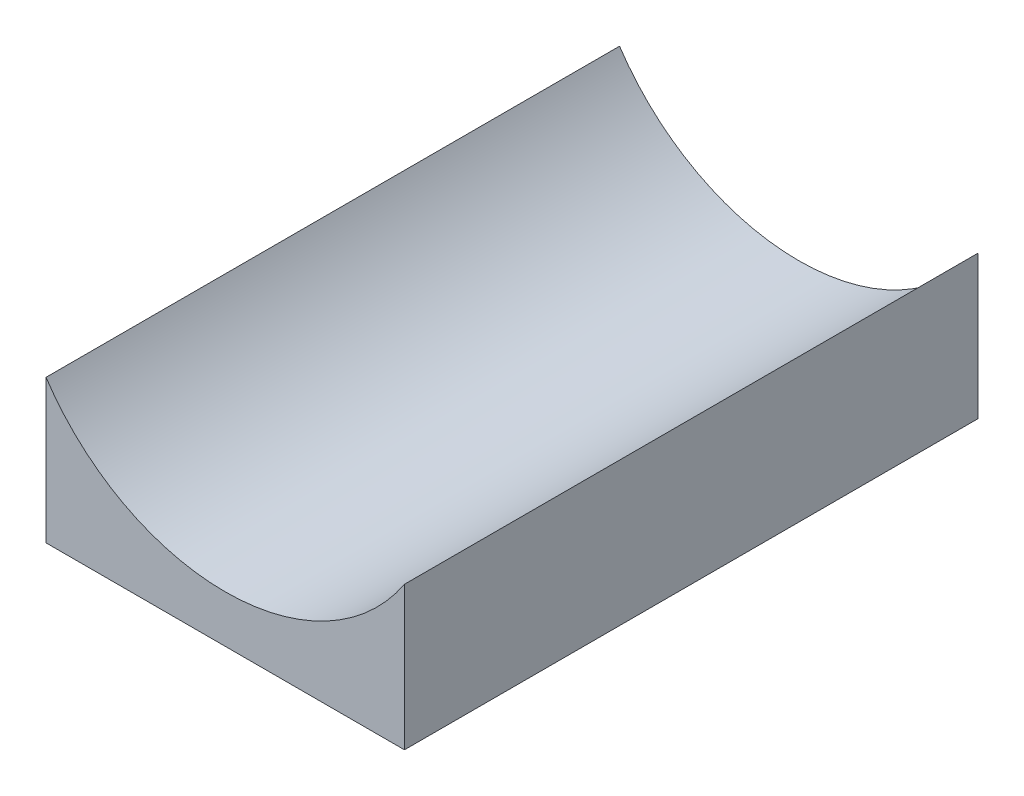
ISO-10303-21;
HEADER;
FILE_DESCRIPTION(('STEP AP214'),'2;1');
FILE_NAME('part.step','',(''),(''),'','','');
FILE_SCHEMA(('AUTOMOTIVE_DESIGN { 1 0 10303 214 1 1 1 1 }'));
ENDSEC;
DATA;
#1=APPLICATION_CONTEXT('core data for automotive mechanical design processes');
#2=APPLICATION_PROTOCOL_DEFINITION('international standard','automotive_design',2000,#1);
#3=PRODUCT_CONTEXT('',#1,'mechanical');
#4=PRODUCT('Part','Part','',(#3));
#5=PRODUCT_RELATED_PRODUCT_CATEGORY('part','',(#4));
#6=PRODUCT_DEFINITION_FORMATION('','',#4);
#7=PRODUCT_DEFINITION_CONTEXT('part definition',#1,'design');
#8=PRODUCT_DEFINITION('design','',#6,#7);
#9=PRODUCT_DEFINITION_SHAPE('','',#8);
#10=(LENGTH_UNIT() NAMED_UNIT(*) SI_UNIT(.MILLI.,.METRE.));
#11=(NAMED_UNIT(*) PLANE_ANGLE_UNIT() SI_UNIT($,.RADIAN.));
#12=(NAMED_UNIT(*) SI_UNIT($,.STERADIAN.) SOLID_ANGLE_UNIT());
#13=UNCERTAINTY_MEASURE_WITH_UNIT(LENGTH_MEASURE(1.E-05),#10,'distance_accuracy_value','');
#14=(GEOMETRIC_REPRESENTATION_CONTEXT(3) GLOBAL_UNCERTAINTY_ASSIGNED_CONTEXT((#13)) GLOBAL_UNIT_ASSIGNED_CONTEXT((#10,
#11,#12)) REPRESENTATION_CONTEXT('',''));
#15=CARTESIAN_POINT('',(0.,0.,0.));
#16=DIRECTION('',(0.,0.,1.));
#17=DIRECTION('',(1.,0.,0.));
#18=AXIS2_PLACEMENT_3D('',#15,#16,#17);
#19=CARTESIAN_POINT('',(12.5,5.,40.));
#20=DIRECTION('',(-1.,0.,0.));
#21=DIRECTION('',(0.,0.,1.));
#22=AXIS2_PLACEMENT_3D('',#19,#20,#21);
#23=PLANE('',#22);
#24=DIRECTION('',(0.,1.,0.));
#25=VECTOR('',#24,1.);
#26=CARTESIAN_POINT('',(12.5,5.,0.));
#27=LINE('',#26,#25);
#28=CARTESIAN_POINT('',(12.5,-5.,0.));
#29=VERTEX_POINT('',#28);
#30=CARTESIAN_POINT('',(12.5,5.,0.));
#31=VERTEX_POINT('',#30);
#32=EDGE_CURVE('E100',#29,#31,#27,.T.);
#33=ORIENTED_EDGE('',*,*,#32,.T.);
#34=DIRECTION('',(0.,0.,-1.));
#35=VECTOR('',#34,1.);
#36=CARTESIAN_POINT('',(12.5,5.,40.));
#37=LINE('',#36,#35);
#38=CARTESIAN_POINT('',(12.5,5.,40.));
#39=VERTEX_POINT('',#38);
#40=EDGE_CURVE('E11',#39,#31,#37,.T.);
#41=ORIENTED_EDGE('',*,*,#40,.F.);
#42=DIRECTION('',(0.,1.,0.));
#43=VECTOR('',#42,1.);
#44=CARTESIAN_POINT('',(12.5,5.,40.));
#45=LINE('',#44,#43);
#46=CARTESIAN_POINT('',(12.5,-5.,40.));
#47=VERTEX_POINT('',#46);
#48=EDGE_CURVE('E88',#47,#39,#45,.T.);
#49=ORIENTED_EDGE('',*,*,#48,.F.);
#50=DIRECTION('',(0.,0.,-1.));
#51=VECTOR('',#50,1.);
#52=CARTESIAN_POINT('',(12.5,-5.,40.));
#53=LINE('',#52,#51);
#54=EDGE_CURVE('E96',#47,#29,#53,.T.);
#55=ORIENTED_EDGE('',*,*,#54,.T.);
#56=EDGE_LOOP('',(#33,#41,#49,#55));
#57=FACE_BOUND('',#56,.T.);
#58=ADVANCED_FACE('F37',(#57),#23,.F.);
#59=CARTESIAN_POINT('',(0.,13.2915619758885,40.));
#60=DIRECTION('',(0.,0.,-1.));
#61=DIRECTION('',(-1.,0.,0.));
#62=AXIS2_PLACEMENT_3D('',#59,#60,#61);
#63=CYLINDRICAL_SURFACE('',#62,15.);
#64=CARTESIAN_POINT('',(0.,13.2915619758885,0.));
#65=DIRECTION('',(0.,0.,-1.));
#66=DIRECTION('',(1.,0.,0.));
#67=AXIS2_PLACEMENT_3D('',#64,#65,#66);
#68=CIRCLE('',#67,15.);
#69=CARTESIAN_POINT('',(-12.5,4.99999999999999,0.));
#70=VERTEX_POINT('',#69);
#71=EDGE_CURVE('E92',#31,#70,#68,.T.);
#72=ORIENTED_EDGE('',*,*,#71,.T.);
#73=DIRECTION('',(0.,0.,-1.));
#74=VECTOR('',#73,1.);
#75=CARTESIAN_POINT('',(-12.5,4.99999999999999,40.));
#76=LINE('',#75,#74);
#77=CARTESIAN_POINT('',(-12.5,4.99999999999999,40.));
#78=VERTEX_POINT('',#77);
#79=EDGE_CURVE('E45',#78,#70,#76,.T.);
#80=ORIENTED_EDGE('',*,*,#79,.F.);
#81=CARTESIAN_POINT('',(0.,13.2915619758885,40.));
#82=DIRECTION('',(0.,0.,-1.));
#83=DIRECTION('',(1.,0.,0.));
#84=AXIS2_PLACEMENT_3D('',#81,#82,#83);
#85=CIRCLE('',#84,15.);
#86=EDGE_CURVE('E83',#39,#78,#85,.T.);
#87=ORIENTED_EDGE('',*,*,#86,.F.);
#88=ORIENTED_EDGE('',*,*,#40,.T.);
#89=EDGE_LOOP('',(#72,#80,#87,#88));
#90=FACE_BOUND('',#89,.T.);
#91=ADVANCED_FACE('F91',(#90),#63,.F.);
#92=CARTESIAN_POINT('',(-12.5,4.99999999999999,40.));
#93=DIRECTION('',(1.,0.,0.));
#94=DIRECTION('',(0.,0.,-1.));
#95=AXIS2_PLACEMENT_3D('',#92,#93,#94);
#96=PLANE('',#95);
#97=DIRECTION('',(0.,-1.,0.));
#98=VECTOR('',#97,1.);
#99=CARTESIAN_POINT('',(-12.5,4.99999999999999,0.));
#100=LINE('',#99,#98);
#101=CARTESIAN_POINT('',(-12.5,-5.,0.));
#102=VERTEX_POINT('',#101);
#103=EDGE_CURVE('E70',#70,#102,#100,.T.);
#104=ORIENTED_EDGE('',*,*,#103,.T.);
#105=DIRECTION('',(0.,0.,-1.));
#106=VECTOR('',#105,1.);
#107=CARTESIAN_POINT('',(-12.5,-5.,40.));
#108=LINE('',#107,#106);
#109=CARTESIAN_POINT('',(-12.5,-5.,40.));
#110=VERTEX_POINT('',#109);
#111=EDGE_CURVE('E93',#110,#102,#108,.T.);
#112=ORIENTED_EDGE('',*,*,#111,.F.);
#113=DIRECTION('',(0.,-1.,0.));
#114=VECTOR('',#113,1.);
#115=CARTESIAN_POINT('',(-12.5,4.99999999999999,40.));
#116=LINE('',#115,#114);
#117=EDGE_CURVE('E86',#78,#110,#116,.T.);
#118=ORIENTED_EDGE('',*,*,#117,.F.);
#119=ORIENTED_EDGE('',*,*,#79,.T.);
#120=EDGE_LOOP('',(#104,#112,#118,#119));
#121=FACE_BOUND('',#120,.T.);
#122=ADVANCED_FACE('F94',(#121),#96,.F.);
#123=CARTESIAN_POINT('',(-12.5,-5.,40.));
#124=DIRECTION('',(0.,1.,0.));
#125=DIRECTION('',(0.,0.,1.));
#126=AXIS2_PLACEMENT_3D('',#123,#124,#125);
#127=PLANE('',#126);
#128=DIRECTION('',(1.,0.,0.));
#129=VECTOR('',#128,1.);
#130=CARTESIAN_POINT('',(-12.5,-5.,0.));
#131=LINE('',#130,#129);
#132=EDGE_CURVE('E76',#102,#29,#131,.T.);
#133=ORIENTED_EDGE('',*,*,#132,.T.);
#134=ORIENTED_EDGE('',*,*,#54,.F.);
#135=DIRECTION('',(1.,0.,0.));
#136=VECTOR('',#135,1.);
#137=CARTESIAN_POINT('',(-12.5,-5.,40.));
#138=LINE('',#137,#136);
#139=EDGE_CURVE('E53',#110,#47,#138,.T.);
#140=ORIENTED_EDGE('',*,*,#139,.F.);
#141=ORIENTED_EDGE('',*,*,#111,.T.);
#142=EDGE_LOOP('',(#133,#134,#140,#141));
#143=FACE_BOUND('',#142,.T.);
#144=ADVANCED_FACE('F107',(#143),#127,.F.);
#145=CARTESIAN_POINT('',(0.,13.2915619758885,40.));
#146=DIRECTION('',(0.,0.,1.));
#147=DIRECTION('',(1.,0.,0.));
#148=AXIS2_PLACEMENT_3D('',#145,#146,#147);
#149=PLANE('',#148);
#150=ORIENTED_EDGE('',*,*,#48,.T.);
#151=ORIENTED_EDGE('',*,*,#86,.T.);
#152=ORIENTED_EDGE('',*,*,#117,.T.);
#153=ORIENTED_EDGE('',*,*,#139,.T.);
#154=EDGE_LOOP('',(#150,#151,#152,#153));
#155=FACE_BOUND('',#154,.T.);
#156=ADVANCED_FACE('F84',(#155),#149,.T.);
#157=CARTESIAN_POINT('',(0.,13.2915619758885,0.));
#158=DIRECTION('',(0.,0.,1.));
#159=DIRECTION('',(1.,0.,0.));
#160=AXIS2_PLACEMENT_3D('',#157,#158,#159);
#161=PLANE('',#160);
#162=ORIENTED_EDGE('',*,*,#32,.F.);
#163=ORIENTED_EDGE('',*,*,#132,.F.);
#164=ORIENTED_EDGE('',*,*,#103,.F.);
#165=ORIENTED_EDGE('',*,*,#71,.F.);
#166=EDGE_LOOP('',(#162,#163,#164,#165));
#167=FACE_BOUND('',#166,.T.);
#168=ADVANCED_FACE('F110',(#167),#161,.F.);
#169=CLOSED_SHELL('',(#58,#91,#122,#144,#156,#168));
#170=MANIFOLD_SOLID_BREP('B2',#169);
#171=ADVANCED_BREP_SHAPE_REPRESENTATION('',(#18,#170),#14);
#172=SHAPE_DEFINITION_REPRESENTATION(#9,#171);
ENDSEC;
END-ISO-10303-21;
